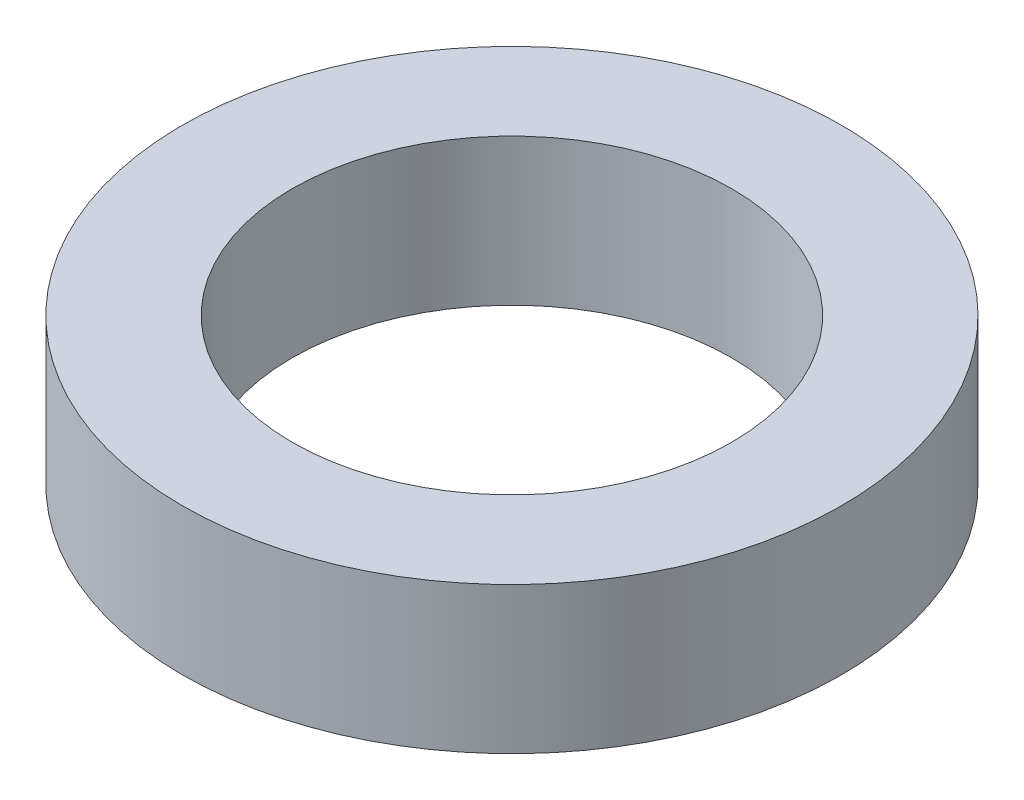
ISO-10303-21;
HEADER;
FILE_DESCRIPTION(('STEP AP214'),'2;1');
FILE_NAME('part.step','',(''),(''),'','','');
FILE_SCHEMA(('AUTOMOTIVE_DESIGN { 1 0 10303 214 1 1 1 1 }'));
ENDSEC;
DATA;
#1=APPLICATION_CONTEXT('core data for automotive mechanical design processes');
#2=APPLICATION_PROTOCOL_DEFINITION('international standard','automotive_design',2000,#1);
#3=PRODUCT_CONTEXT('',#1,'mechanical');
#4=PRODUCT('Part','Part','',(#3));
#5=PRODUCT_RELATED_PRODUCT_CATEGORY('part','',(#4));
#6=PRODUCT_DEFINITION_FORMATION('','',#4);
#7=PRODUCT_DEFINITION_CONTEXT('part definition',#1,'design');
#8=PRODUCT_DEFINITION('design','',#6,#7);
#9=PRODUCT_DEFINITION_SHAPE('','',#8);
#10=(LENGTH_UNIT() NAMED_UNIT(*) SI_UNIT(.MILLI.,.METRE.));
#11=(NAMED_UNIT(*) PLANE_ANGLE_UNIT() SI_UNIT($,.RADIAN.));
#12=(NAMED_UNIT(*) SI_UNIT($,.STERADIAN.) SOLID_ANGLE_UNIT());
#13=UNCERTAINTY_MEASURE_WITH_UNIT(LENGTH_MEASURE(1.E-05),#10,'distance_accuracy_value','');
#14=(GEOMETRIC_REPRESENTATION_CONTEXT(3) GLOBAL_UNCERTAINTY_ASSIGNED_CONTEXT((#13)) GLOBAL_UNIT_ASSIGNED_CONTEXT((#10,
#11,#12)) REPRESENTATION_CONTEXT('',''));
#15=CARTESIAN_POINT('',(0.,0.,0.));
#16=DIRECTION('',(0.,0.,1.));
#17=DIRECTION('',(1.,0.,0.));
#18=AXIS2_PLACEMENT_3D('',#15,#16,#17);
#19=CARTESIAN_POINT('',(0.,4.,0.));
#20=DIRECTION('',(0.,1.,0.));
#21=DIRECTION('',(0.,0.,1.));
#22=AXIS2_PLACEMENT_3D('',#19,#20,#21);
#23=PLANE('',#22);
#24=CARTESIAN_POINT('',(0.,4.,0.));
#25=DIRECTION('',(0.,1.,0.));
#26=DIRECTION('',(0.,0.,1.));
#27=AXIS2_PLACEMENT_3D('',#24,#25,#26);
#28=CIRCLE('',#27,9.);
#29=CARTESIAN_POINT('',(0.,4.,9.));
#30=VERTEX_POINT('',#29);
#31=EDGE_CURVE('E10',#30,#30,#28,.T.);
#32=ORIENTED_EDGE('',*,*,#31,.T.);
#33=EDGE_LOOP('',(#32));
#34=FACE_BOUND('',#33,.T.);
#35=CARTESIAN_POINT('',(0.,4.,0.));
#36=DIRECTION('',(0.,1.,0.));
#37=DIRECTION('',(0.,0.,1.));
#38=AXIS2_PLACEMENT_3D('',#35,#36,#37);
#39=CIRCLE('',#38,6.);
#40=CARTESIAN_POINT('',(0.,4.,6.));
#41=VERTEX_POINT('',#40);
#42=EDGE_CURVE('E50',#41,#41,#39,.T.);
#43=ORIENTED_EDGE('',*,*,#42,.F.);
#44=EDGE_LOOP('',(#43));
#45=FACE_BOUND('',#44,.T.);
#46=ADVANCED_FACE('F37',(#34,#45),#23,.T.);
#47=CARTESIAN_POINT('',(0.,0.,0.));
#48=DIRECTION('',(0.,1.,0.));
#49=DIRECTION('',(0.,0.,1.));
#50=AXIS2_PLACEMENT_3D('',#47,#48,#49);
#51=PLANE('',#50);
#52=CARTESIAN_POINT('',(0.,0.,0.));
#53=DIRECTION('',(0.,1.,0.));
#54=DIRECTION('',(0.,0.,1.));
#55=AXIS2_PLACEMENT_3D('',#52,#53,#54);
#56=CIRCLE('',#55,9.);
#57=CARTESIAN_POINT('',(0.,0.,9.));
#58=VERTEX_POINT('',#57);
#59=EDGE_CURVE('E41',#58,#58,#56,.T.);
#60=ORIENTED_EDGE('',*,*,#59,.F.);
#61=EDGE_LOOP('',(#60));
#62=FACE_BOUND('',#61,.T.);
#63=CARTESIAN_POINT('',(0.,0.,0.));
#64=DIRECTION('',(0.,1.,0.));
#65=DIRECTION('',(0.,0.,1.));
#66=AXIS2_PLACEMENT_3D('',#63,#64,#65);
#67=CIRCLE('',#66,6.);
#68=CARTESIAN_POINT('',(0.,0.,6.));
#69=VERTEX_POINT('',#68);
#70=EDGE_CURVE('E52',#69,#69,#67,.T.);
#71=ORIENTED_EDGE('',*,*,#70,.T.);
#72=EDGE_LOOP('',(#71));
#73=FACE_BOUND('',#72,.T.);
#74=ADVANCED_FACE('F64',(#62,#73),#51,.F.);
#75=CARTESIAN_POINT('',(0.,4.,0.));
#76=DIRECTION('',(0.,-1.,0.));
#77=DIRECTION('',(0.,0.,-1.));
#78=AXIS2_PLACEMENT_3D('',#75,#76,#77);
#79=CYLINDRICAL_SURFACE('',#78,9.);
#80=ORIENTED_EDGE('',*,*,#31,.F.);
#81=EDGE_LOOP('',(#80));
#82=FACE_BOUND('',#81,.T.);
#83=ORIENTED_EDGE('',*,*,#59,.T.);
#84=EDGE_LOOP('',(#83));
#85=FACE_BOUND('',#84,.T.);
#86=ADVANCED_FACE('F39',(#82,#85),#79,.T.);
#87=CARTESIAN_POINT('',(0.,4.,0.));
#88=DIRECTION('',(0.,-1.,0.));
#89=DIRECTION('',(0.,0.,-1.));
#90=AXIS2_PLACEMENT_3D('',#87,#88,#89);
#91=CYLINDRICAL_SURFACE('',#90,6.);
#92=ORIENTED_EDGE('',*,*,#42,.T.);
#93=EDGE_LOOP('',(#92));
#94=FACE_BOUND('',#93,.T.);
#95=ORIENTED_EDGE('',*,*,#70,.F.);
#96=EDGE_LOOP('',(#95));
#97=FACE_BOUND('',#96,.T.);
#98=ADVANCED_FACE('F60',(#94,#97),#91,.F.);
#99=CLOSED_SHELL('',(#46,#74,#86,#98));
#100=MANIFOLD_SOLID_BREP('B2',#99);
#101=ADVANCED_BREP_SHAPE_REPRESENTATION('',(#18,#100),#14);
#102=SHAPE_DEFINITION_REPRESENTATION(#9,#101);
ENDSEC;
END-ISO-10303-21;
